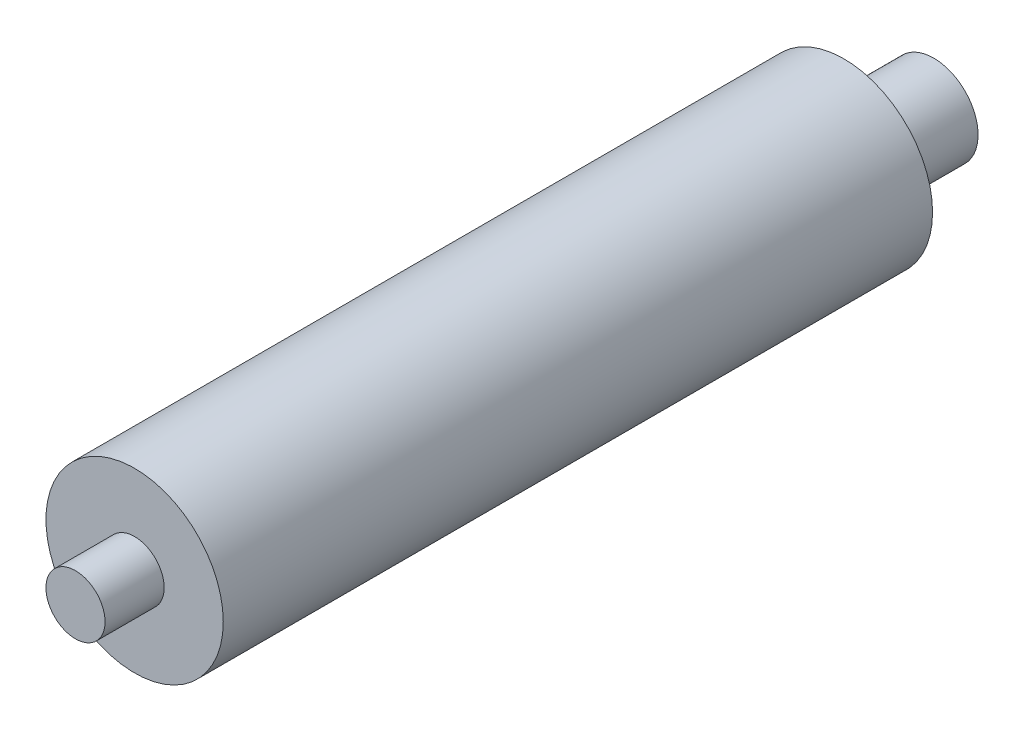
ISO-10303-21;
HEADER;
FILE_DESCRIPTION(('STEP AP214'),'2;1');
FILE_NAME('part.step','',(''),(''),'','','');
FILE_SCHEMA(('AUTOMOTIVE_DESIGN { 1 0 10303 214 1 1 1 1 }'));
ENDSEC;
DATA;
#1=APPLICATION_CONTEXT('core data for automotive mechanical design processes');
#2=APPLICATION_PROTOCOL_DEFINITION('international standard','automotive_design',2000,#1);
#3=PRODUCT_CONTEXT('',#1,'mechanical');
#4=PRODUCT('Part','Part','',(#3));
#5=PRODUCT_RELATED_PRODUCT_CATEGORY('part','',(#4));
#6=PRODUCT_DEFINITION_FORMATION('','',#4);
#7=PRODUCT_DEFINITION_CONTEXT('part definition',#1,'design');
#8=PRODUCT_DEFINITION('design','',#6,#7);
#9=PRODUCT_DEFINITION_SHAPE('','',#8);
#10=(LENGTH_UNIT() NAMED_UNIT(*) SI_UNIT(.MILLI.,.METRE.));
#11=(NAMED_UNIT(*) PLANE_ANGLE_UNIT() SI_UNIT($,.RADIAN.));
#12=(NAMED_UNIT(*) SI_UNIT($,.STERADIAN.) SOLID_ANGLE_UNIT());
#13=UNCERTAINTY_MEASURE_WITH_UNIT(LENGTH_MEASURE(1.E-05),#10,'distance_accuracy_value','');
#14=(GEOMETRIC_REPRESENTATION_CONTEXT(3) GLOBAL_UNCERTAINTY_ASSIGNED_CONTEXT((#13)) GLOBAL_UNIT_ASSIGNED_CONTEXT((#10,
#11,#12)) REPRESENTATION_CONTEXT('',''));
#15=CARTESIAN_POINT('',(0.,0.,0.));
#16=DIRECTION('',(0.,0.,1.));
#17=DIRECTION('',(1.,0.,0.));
#18=AXIS2_PLACEMENT_3D('',#15,#16,#17);
#19=CARTESIAN_POINT('',(0.,0.,76.2));
#20=DIRECTION('',(0.,0.,-1.));
#21=DIRECTION('',(-1.,0.,0.));
#22=AXIS2_PLACEMENT_3D('',#19,#20,#21);
#23=CYLINDRICAL_SURFACE('',#22,9.525);
#24=CARTESIAN_POINT('',(0.,0.,76.2));
#25=DIRECTION('',(0.,0.,1.));
#26=DIRECTION('',(1.,0.,0.));
#27=AXIS2_PLACEMENT_3D('',#24,#25,#26);
#28=CIRCLE('',#27,9.525);
#29=CARTESIAN_POINT('',(9.525,0.,76.2));
#30=VERTEX_POINT('',#29);
#31=EDGE_CURVE('E58',#30,#30,#28,.T.);
#32=ORIENTED_EDGE('',*,*,#31,.F.);
#33=EDGE_LOOP('',(#32));
#34=FACE_BOUND('',#33,.T.);
#35=CARTESIAN_POINT('',(0.,0.,0.));
#36=DIRECTION('',(0.,0.,1.));
#37=DIRECTION('',(1.,0.,0.));
#38=AXIS2_PLACEMENT_3D('',#35,#36,#37);
#39=CIRCLE('',#38,9.525);
#40=CARTESIAN_POINT('',(9.525,0.,0.));
#41=VERTEX_POINT('',#40);
#42=EDGE_CURVE('E45',#41,#41,#39,.T.);
#43=ORIENTED_EDGE('',*,*,#42,.T.);
#44=EDGE_LOOP('',(#43));
#45=FACE_BOUND('',#44,.T.);
#46=ADVANCED_FACE('F42',(#34,#45),#23,.T.);
#47=CARTESIAN_POINT('',(0.,0.,76.2));
#48=DIRECTION('',(0.,0.,1.));
#49=DIRECTION('',(1.,0.,0.));
#50=AXIS2_PLACEMENT_3D('',#47,#48,#49);
#51=PLANE('',#50);
#52=CARTESIAN_POINT('',(0.,0.,76.2));
#53=DIRECTION('',(0.,0.,1.));
#54=DIRECTION('',(1.,0.,0.));
#55=AXIS2_PLACEMENT_3D('',#52,#53,#54);
#56=CIRCLE('',#55,3.175);
#57=CARTESIAN_POINT('',(3.175,0.,76.2));
#58=VERTEX_POINT('',#57);
#59=EDGE_CURVE('E50',#58,#58,#56,.T.);
#60=ORIENTED_EDGE('',*,*,#59,.F.);
#61=EDGE_LOOP('',(#60));
#62=FACE_BOUND('',#61,.T.);
#63=ORIENTED_EDGE('',*,*,#31,.T.);
#64=EDGE_LOOP('',(#63));
#65=FACE_BOUND('',#64,.T.);
#66=ADVANCED_FACE('F82',(#62,#65),#51,.T.);
#67=CARTESIAN_POINT('',(0.,0.,0.));
#68=DIRECTION('',(0.,0.,1.));
#69=DIRECTION('',(1.,0.,0.));
#70=AXIS2_PLACEMENT_3D('',#67,#68,#69);
#71=PLANE('',#70);
#72=CARTESIAN_POINT('',(0.,0.,0.));
#73=DIRECTION('',(0.,0.,-1.));
#74=DIRECTION('',(-1.,0.,0.));
#75=AXIS2_PLACEMENT_3D('',#72,#73,#74);
#76=CIRCLE('',#75,4.7625);
#77=CARTESIAN_POINT('',(-4.7625,0.,0.));
#78=VERTEX_POINT('',#77);
#79=EDGE_CURVE('E10',#78,#78,#76,.T.);
#80=ORIENTED_EDGE('',*,*,#79,.F.);
#81=EDGE_LOOP('',(#80));
#82=FACE_BOUND('',#81,.T.);
#83=ORIENTED_EDGE('',*,*,#42,.F.);
#84=EDGE_LOOP('',(#83));
#85=FACE_BOUND('',#84,.T.);
#86=ADVANCED_FACE('F79',(#82,#85),#71,.F.);
#87=CARTESIAN_POINT('',(0.,0.,82.55));
#88=DIRECTION('',(0.,0.,-1.));
#89=DIRECTION('',(-1.,0.,0.));
#90=AXIS2_PLACEMENT_3D('',#87,#88,#89);
#91=CYLINDRICAL_SURFACE('',#90,3.175);
#92=CARTESIAN_POINT('',(0.,0.,82.55));
#93=DIRECTION('',(0.,0.,1.));
#94=DIRECTION('',(1.,0.,0.));
#95=AXIS2_PLACEMENT_3D('',#92,#93,#94);
#96=CIRCLE('',#95,3.175);
#97=CARTESIAN_POINT('',(3.175,0.,82.55));
#98=VERTEX_POINT('',#97);
#99=EDGE_CURVE('E63',#98,#98,#96,.T.);
#100=ORIENTED_EDGE('',*,*,#99,.F.);
#101=EDGE_LOOP('',(#100));
#102=FACE_BOUND('',#101,.T.);
#103=ORIENTED_EDGE('',*,*,#59,.T.);
#104=EDGE_LOOP('',(#103));
#105=FACE_BOUND('',#104,.T.);
#106=ADVANCED_FACE('F81',(#102,#105),#91,.T.);
#107=CARTESIAN_POINT('',(0.,0.,82.55));
#108=DIRECTION('',(0.,0.,1.));
#109=DIRECTION('',(1.,0.,0.));
#110=AXIS2_PLACEMENT_3D('',#107,#108,#109);
#111=PLANE('',#110);
#112=ORIENTED_EDGE('',*,*,#99,.T.);
#113=EDGE_LOOP('',(#112));
#114=FACE_BOUND('',#113,.T.);
#115=ADVANCED_FACE('F88',(#114),#111,.T.);
#116=CARTESIAN_POINT('',(0.,0.,-9.65199999999999));
#117=DIRECTION('',(0.,0.,1.));
#118=DIRECTION('',(1.,0.,0.));
#119=AXIS2_PLACEMENT_3D('',#116,#117,#118);
#120=CYLINDRICAL_SURFACE('',#119,4.7625);
#121=CARTESIAN_POINT('',(0.,0.,-9.65199999999999));
#122=DIRECTION('',(0.,0.,-1.));
#123=DIRECTION('',(-1.,0.,0.));
#124=AXIS2_PLACEMENT_3D('',#121,#122,#123);
#125=CIRCLE('',#124,4.7625);
#126=CARTESIAN_POINT('',(-4.7625,0.,-9.65199999999999));
#127=VERTEX_POINT('',#126);
#128=EDGE_CURVE('E62',#127,#127,#125,.T.);
#129=ORIENTED_EDGE('',*,*,#128,.F.);
#130=EDGE_LOOP('',(#129));
#131=FACE_BOUND('',#130,.T.);
#132=ORIENTED_EDGE('',*,*,#79,.T.);
#133=EDGE_LOOP('',(#132));
#134=FACE_BOUND('',#133,.T.);
#135=ADVANCED_FACE('F120',(#131,#134),#120,.T.);
#136=CARTESIAN_POINT('',(0.,0.,-9.65199999999999));
#137=DIRECTION('',(0.,0.,-1.));
#138=DIRECTION('',(-1.,0.,0.));
#139=AXIS2_PLACEMENT_3D('',#136,#137,#138);
#140=PLANE('',#139);
#141=ORIENTED_EDGE('',*,*,#128,.T.);
#142=EDGE_LOOP('',(#141));
#143=FACE_BOUND('',#142,.T.);
#144=ADVANCED_FACE('F130',(#143),#140,.T.);
#145=CLOSED_SHELL('',(#46,#66,#86,#106,#115,#135,#144));
#146=MANIFOLD_SOLID_BREP('B2',#145);
#147=ADVANCED_BREP_SHAPE_REPRESENTATION('',(#18,#146),#14);
#148=SHAPE_DEFINITION_REPRESENTATION(#9,#147);
ENDSEC;
END-ISO-10303-21;
